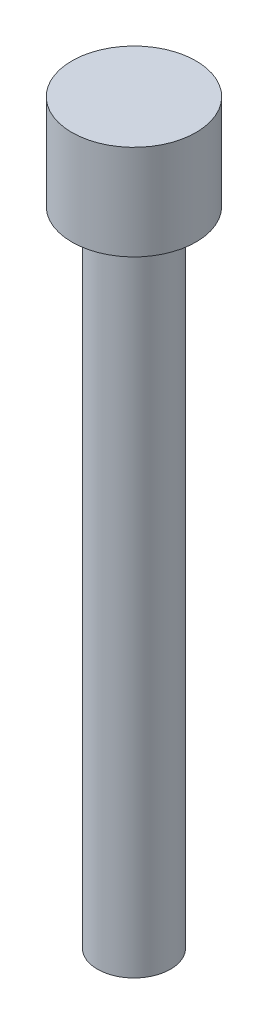
ISO-10303-21;
HEADER;
FILE_DESCRIPTION(('STEP AP214'),'2;1');
FILE_NAME('part.step','',(''),(''),'','','');
FILE_SCHEMA(('AUTOMOTIVE_DESIGN { 1 0 10303 214 1 1 1 1 }'));
ENDSEC;
DATA;
#1=APPLICATION_CONTEXT('core data for automotive mechanical design processes');
#2=APPLICATION_PROTOCOL_DEFINITION('international standard','automotive_design',2000,#1);
#3=PRODUCT_CONTEXT('',#1,'mechanical');
#4=PRODUCT('Part','Part','',(#3));
#5=PRODUCT_RELATED_PRODUCT_CATEGORY('part','',(#4));
#6=PRODUCT_DEFINITION_FORMATION('','',#4);
#7=PRODUCT_DEFINITION_CONTEXT('part definition',#1,'design');
#8=PRODUCT_DEFINITION('design','',#6,#7);
#9=PRODUCT_DEFINITION_SHAPE('','',#8);
#10=(LENGTH_UNIT() NAMED_UNIT(*) SI_UNIT(.MILLI.,.METRE.));
#11=(NAMED_UNIT(*) PLANE_ANGLE_UNIT() SI_UNIT($,.RADIAN.));
#12=(NAMED_UNIT(*) SI_UNIT($,.STERADIAN.) SOLID_ANGLE_UNIT());
#13=UNCERTAINTY_MEASURE_WITH_UNIT(LENGTH_MEASURE(1.E-05),#10,'distance_accuracy_value','');
#14=(GEOMETRIC_REPRESENTATION_CONTEXT(3) GLOBAL_UNCERTAINTY_ASSIGNED_CONTEXT((#13)) GLOBAL_UNIT_ASSIGNED_CONTEXT((#10,
#11,#12)) REPRESENTATION_CONTEXT('',''));
#15=CARTESIAN_POINT('',(0.,0.,0.));
#16=DIRECTION('',(0.,0.,1.));
#17=DIRECTION('',(1.,0.,0.));
#18=AXIS2_PLACEMENT_3D('',#15,#16,#17);
#19=CARTESIAN_POINT('',(0.,44.,0.));
#20=DIRECTION('',(0.,-1.,0.));
#21=DIRECTION('',(0.,0.,-1.));
#22=AXIS2_PLACEMENT_3D('',#19,#20,#21);
#23=CYLINDRICAL_SURFACE('',#22,2.5);
#24=CARTESIAN_POINT('',(0.,44.,0.));
#25=DIRECTION('',(0.,1.,0.));
#26=DIRECTION('',(0.,0.,1.));
#27=AXIS2_PLACEMENT_3D('',#24,#25,#26);
#28=CIRCLE('',#27,2.5);
#29=CARTESIAN_POINT('',(0.,44.,2.5));
#30=VERTEX_POINT('',#29);
#31=EDGE_CURVE('E10',#30,#30,#28,.T.);
#32=ORIENTED_EDGE('',*,*,#31,.F.);
#33=EDGE_LOOP('',(#32));
#34=FACE_BOUND('',#33,.T.);
#35=CARTESIAN_POINT('',(0.,0.,0.));
#36=DIRECTION('',(0.,1.,0.));
#37=DIRECTION('',(0.,0.,1.));
#38=AXIS2_PLACEMENT_3D('',#35,#36,#37);
#39=CIRCLE('',#38,2.5);
#40=CARTESIAN_POINT('',(0.,0.,2.5));
#41=VERTEX_POINT('',#40);
#42=EDGE_CURVE('E38',#41,#41,#39,.T.);
#43=ORIENTED_EDGE('',*,*,#42,.T.);
#44=EDGE_LOOP('',(#43));
#45=FACE_BOUND('',#44,.T.);
#46=ADVANCED_FACE('F35',(#34,#45),#23,.T.);
#47=CARTESIAN_POINT('',(0.,0.,0.));
#48=DIRECTION('',(0.,1.,0.));
#49=DIRECTION('',(0.,0.,1.));
#50=AXIS2_PLACEMENT_3D('',#47,#48,#49);
#51=PLANE('',#50);
#52=ORIENTED_EDGE('',*,*,#42,.F.);
#53=EDGE_LOOP('',(#52));
#54=FACE_BOUND('',#53,.T.);
#55=ADVANCED_FACE('F58',(#54),#51,.F.);
#56=CARTESIAN_POINT('',(0.,50.5,0.));
#57=DIRECTION('',(0.,-1.,0.));
#58=DIRECTION('',(0.,0.,-1.));
#59=AXIS2_PLACEMENT_3D('',#56,#57,#58);
#60=CYLINDRICAL_SURFACE('',#59,4.25);
#61=CARTESIAN_POINT('',(0.,50.5,0.));
#62=DIRECTION('',(0.,1.,0.));
#63=DIRECTION('',(0.,0.,1.));
#64=AXIS2_PLACEMENT_3D('',#61,#62,#63);
#65=CIRCLE('',#64,4.25);
#66=CARTESIAN_POINT('',(0.,50.5,4.25));
#67=VERTEX_POINT('',#66);
#68=EDGE_CURVE('E45',#67,#67,#65,.T.);
#69=ORIENTED_EDGE('',*,*,#68,.F.);
#70=EDGE_LOOP('',(#69));
#71=FACE_BOUND('',#70,.T.);
#72=CARTESIAN_POINT('',(0.,44.,0.));
#73=DIRECTION('',(0.,1.,0.));
#74=DIRECTION('',(0.,0.,1.));
#75=AXIS2_PLACEMENT_3D('',#72,#73,#74);
#76=CIRCLE('',#75,4.25);
#77=CARTESIAN_POINT('',(0.,44.,4.25));
#78=VERTEX_POINT('',#77);
#79=EDGE_CURVE('E47',#78,#78,#76,.T.);
#80=ORIENTED_EDGE('',*,*,#79,.T.);
#81=EDGE_LOOP('',(#80));
#82=FACE_BOUND('',#81,.T.);
#83=ADVANCED_FACE('F55',(#71,#82),#60,.T.);
#84=CARTESIAN_POINT('',(0.,50.5,0.));
#85=DIRECTION('',(0.,1.,0.));
#86=DIRECTION('',(0.,0.,1.));
#87=AXIS2_PLACEMENT_3D('',#84,#85,#86);
#88=PLANE('',#87);
#89=ORIENTED_EDGE('',*,*,#68,.T.);
#90=EDGE_LOOP('',(#89));
#91=FACE_BOUND('',#90,.T.);
#92=ADVANCED_FACE('F53',(#91),#88,.T.);
#93=CARTESIAN_POINT('',(0.,44.,0.));
#94=DIRECTION('',(0.,1.,0.));
#95=DIRECTION('',(0.,0.,1.));
#96=AXIS2_PLACEMENT_3D('',#93,#94,#95);
#97=PLANE('',#96);
#98=ORIENTED_EDGE('',*,*,#31,.T.);
#99=EDGE_LOOP('',(#98));
#100=FACE_BOUND('',#99,.T.);
#101=ORIENTED_EDGE('',*,*,#79,.F.);
#102=EDGE_LOOP('',(#101));
#103=FACE_BOUND('',#102,.T.);
#104=ADVANCED_FACE('F62',(#100,#103),#97,.F.);
#105=CLOSED_SHELL('',(#46,#55,#83,#92,#104));
#106=MANIFOLD_SOLID_BREP('B2',#105);
#107=ADVANCED_BREP_SHAPE_REPRESENTATION('',(#18,#106),#14);
#108=SHAPE_DEFINITION_REPRESENTATION(#9,#107);
ENDSEC;
END-ISO-10303-21;
